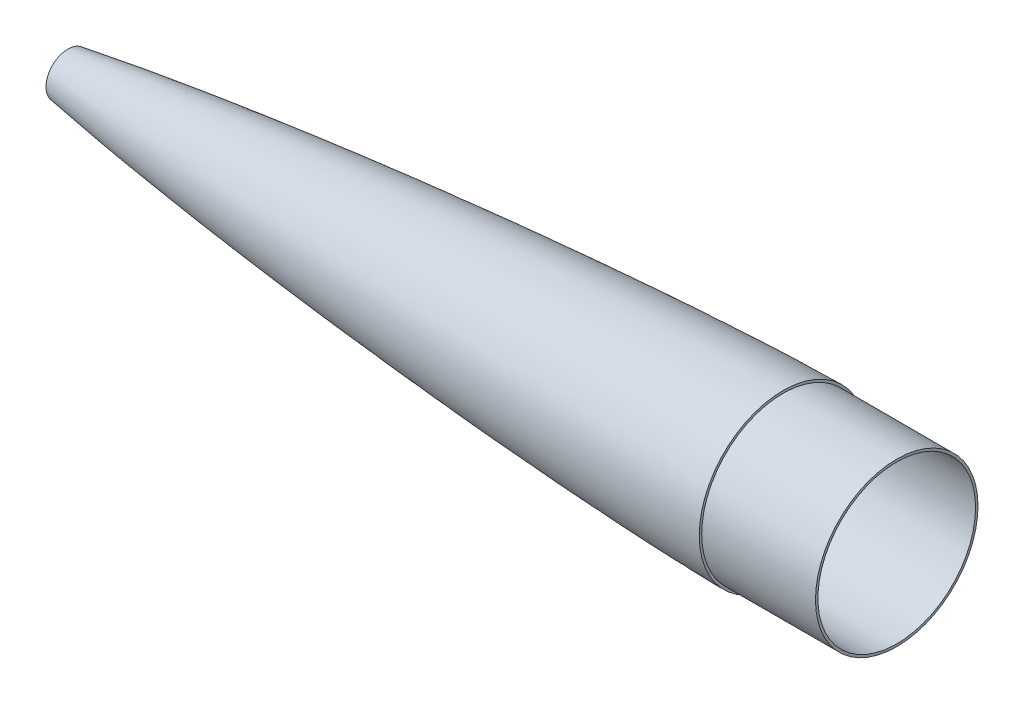
ISO-10303-21;
HEADER;
FILE_DESCRIPTION(('STEP AP214'),'2;1');
FILE_NAME('part.step','',(''),(''),'','','');
FILE_SCHEMA(('AUTOMOTIVE_DESIGN { 1 0 10303 214 1 1 1 1 }'));
ENDSEC;
DATA;
#1=APPLICATION_CONTEXT('core data for automotive mechanical design processes');
#2=APPLICATION_PROTOCOL_DEFINITION('international standard','automotive_design',2000,#1);
#3=PRODUCT_CONTEXT('',#1,'mechanical');
#4=PRODUCT('Part','Part','',(#3));
#5=PRODUCT_RELATED_PRODUCT_CATEGORY('part','',(#4));
#6=PRODUCT_DEFINITION_FORMATION('','',#4);
#7=PRODUCT_DEFINITION_CONTEXT('part definition',#1,'design');
#8=PRODUCT_DEFINITION('design','',#6,#7);
#9=PRODUCT_DEFINITION_SHAPE('','',#8);
#10=(LENGTH_UNIT() NAMED_UNIT(*) SI_UNIT(.MILLI.,.METRE.));
#11=(NAMED_UNIT(*) PLANE_ANGLE_UNIT() SI_UNIT($,.RADIAN.));
#12=(NAMED_UNIT(*) SI_UNIT($,.STERADIAN.) SOLID_ANGLE_UNIT());
#13=UNCERTAINTY_MEASURE_WITH_UNIT(LENGTH_MEASURE(1.E-05),#10,'distance_accuracy_value','');
#14=(GEOMETRIC_REPRESENTATION_CONTEXT(3) GLOBAL_UNCERTAINTY_ASSIGNED_CONTEXT((#13)) GLOBAL_UNIT_ASSIGNED_CONTEXT((#10,
#11,#12)) REPRESENTATION_CONTEXT('',''));
#15=CARTESIAN_POINT('',(0.,0.,0.));
#16=DIRECTION('',(0.,0.,1.));
#17=DIRECTION('',(1.,0.,0.));
#18=AXIS2_PLACEMENT_3D('',#15,#16,#17);
#19=CARTESIAN_POINT('',(635.,0.,-65.405));
#20=CARTESIAN_POINT('',(632.980968041379,0.,-65.3999049079982));
#21=CARTESIAN_POINT('',(628.94305151866,0.,-65.3607987649683));
#22=CARTESIAN_POINT('',(620.867800743746,0.,-65.2384258351577));
#23=CARTESIAN_POINT('',(607.876612197189,0.,-64.9420444267637));
#24=CARTESIAN_POINT('',(591.989866173893,0.,-64.4665825864282));
#25=CARTESIAN_POINT('',(568.294487812522,0.,-63.5924578117391));
#26=CARTESIAN_POINT('',(538.814064527871,0.,-62.2664605978091));
#27=CARTESIAN_POINT('',(504.434100625344,0.,-60.4361863708922));
#28=CARTESIAN_POINT('',(465.161890456535,0.,-58.0127528854531));
#29=CARTESIAN_POINT('',(425.9093857375,0.,-55.2895252497302));
#30=CARTESIAN_POINT('',(386.677550901075,0.,-52.2836135264071));
#31=CARTESIAN_POINT('',(347.467762428279,0.,-49.0025673324939));
#32=CARTESIAN_POINT('',(308.282068325666,0.,-45.4454012222469));
#33=CARTESIAN_POINT('',(269.123174714224,0.,-41.603760555562));
#34=CARTESIAN_POINT('',(229.995170684783,0.,-37.4592339547087));
#35=CARTESIAN_POINT('',(190.903568878781,0.,-32.9826992551562));
#36=CARTESIAN_POINT('',(151.85753033752,0.,-28.1241973222402));
#37=CARTESIAN_POINT('',(112.870807325212,0.,-22.8061369351956));
#38=CARTESIAN_POINT('',(77.9573287846347,0.,-17.4873019784258));
#39=CARTESIAN_POINT('',(49.1787935546812,0.,-12.5135793040534));
#40=CARTESIAN_POINT('',(28.2617417770004,0.,-8.30499279351693));
#41=CARTESIAN_POINT('',(16.0220282949452,0.,-5.4462502005679));
#42=CARTESIAN_POINT('',(8.93318062814782,0.,-3.51548578780448));
#43=CARTESIAN_POINT('',(5.16339541485648,0.,-2.32840347516784));
#44=CARTESIAN_POINT('',(3.11582679923168,0.,-1.59218900684347));
#45=CARTESIAN_POINT('',(1.97027691704136,0.,-1.1275016191836));
#46=CARTESIAN_POINT('',(1.33181141167437,0.,-0.839140676757944));
#47=CARTESIAN_POINT('',(0.956716029049632,0.,-0.653660621097922));
#48=CARTESIAN_POINT('',(0.715531562152641,0.,-0.52514659793293));
#49=CARTESIAN_POINT('',(0.550210431495344,0.,-0.431764809009295));
#50=CARTESIAN_POINT('',(0.406270251751128,0.,-0.344359984283258));
#51=CARTESIAN_POINT('',(0.283649615611131,0.,-0.263361482709999));
#52=CARTESIAN_POINT('',(0.181602895816823,0.,-0.188889432865869));
#53=CARTESIAN_POINT('',(0.109817079168361,0.,-0.130424863371354));
#54=CARTESIAN_POINT('',(0.0569836765196337,0.,-0.080426254677498));
#55=CARTESIAN_POINT('',(0.0222716682134033,0.,-0.0403845586316777));
#56=CARTESIAN_POINT('',(0.00752296936524707,0.,-0.0183675987536797));
#57=CARTESIAN_POINT('',(0.00219211488346474,0.,-0.00629020802223133));
#58=CARTESIAN_POINT('',(0.,0.,0.));
#59=B_SPLINE_CURVE_WITH_KNOTS('',4,(#19,#20,#21,#22,#23,#24,#25,#26,#27,#28,#29,#30,#31,#32,#33,
#34,#35,#36,#37,#38,#39,#40,#41,#42,#43,#44,#45,#46,#47,#48,#49,#50,#51,#52,#53,#54,#55,#56,#57,
#58),.UNSPECIFIED.,.F.,.F.,(5,1,1,1,1,1,1,1,1,1,1,1,1,1,1,1,1,1,1,1,1,1,1,1,1,1,1,1,1,1,1,1,1,1,
1,1,5),(0.,0.0126278600836156,0.0252557201672313,0.0505114403344626,0.0812725997628029,
0.112033759191143,0.173556078208551,0.235078396298971,0.296600715210933,0.358123034494871,
0.419645352372099,0.481167670690979,0.542689989321029,0.604212308113024,0.665734626856386,
0.727256945203041,0.788779262537685,0.850301578000527,0.911823895791277,0.948128969524394,
0.971421118017023,0.983729988096585,0.990421707276453,0.994070390445943,0.996134035175531,
0.997335608030765,0.998151497389768,0.998451073952135,0.998750650514502,0.999044750264593,
0.999338850014684,0.999504137511013,0.999669425007342,0.999834712503671,0.999917356251836,
0.999958678125918,1.),.UNSPECIFIED.);
#60=CARTESIAN_POINT('',(0.,0.,0.));
#61=DIRECTION('',(-1.,0.,0.));
#62=AXIS1_PLACEMENT('',#60,#61);
#63=SURFACE_OF_REVOLUTION('',#59,#62);
#64=CARTESIAN_POINT('',(76.2,0.,0.));
#65=DIRECTION('',(-1.,0.,0.));
#66=DIRECTION('',(0.,0.,1.));
#67=AXIS2_PLACEMENT_3D('',#64,#65,#66);
#68=CIRCLE('',#67,17.0521841131544);
#69=CARTESIAN_POINT('',(76.2,0.,17.0521841131544));
#70=VERTEX_POINT('',#69);
#71=EDGE_CURVE('E102',#70,#70,#68,.F.);
#72=ORIENTED_EDGE('',*,*,#71,.T.);
#73=EDGE_LOOP('',(#72));
#74=FACE_BOUND('',#73,.T.);
#75=CARTESIAN_POINT('',(635.,0.,0.));
#76=DIRECTION('',(-1.,0.,0.));
#77=DIRECTION('',(0.,0.,1.));
#78=AXIS2_PLACEMENT_3D('',#75,#76,#77);
#79=CIRCLE('',#78,65.405);
#80=CARTESIAN_POINT('',(635.,0.,65.405));
#81=VERTEX_POINT('',#80);
#82=EDGE_CURVE('E43',#81,#81,#79,.T.);
#83=ORIENTED_EDGE('',*,*,#82,.T.);
#84=EDGE_LOOP('',(#83));
#85=FACE_BOUND('',#84,.T.);
#86=ADVANCED_FACE('F35',(#74,#85),#63,.T.);
#87=CARTESIAN_POINT('',(635.,0.,0.));
#88=DIRECTION('',(-1.,0.,0.));
#89=DIRECTION('',(0.,0.,1.));
#90=AXIS2_PLACEMENT_3D('',#87,#88,#89);
#91=PLANE('',#90);
#92=CARTESIAN_POINT('',(635.,0.,0.));
#93=DIRECTION('',(-1.,0.,0.));
#94=DIRECTION('',(0.,0.,1.));
#95=AXIS2_PLACEMENT_3D('',#92,#93,#94);
#96=CIRCLE('',#95,63.5);
#97=CARTESIAN_POINT('',(635.,0.,63.5));
#98=VERTEX_POINT('',#97);
#99=EDGE_CURVE('E10',#98,#98,#96,.F.);
#100=ORIENTED_EDGE('',*,*,#99,.F.);
#101=EDGE_LOOP('',(#100));
#102=FACE_BOUND('',#101,.T.);
#103=ORIENTED_EDGE('',*,*,#82,.F.);
#104=EDGE_LOOP('',(#103));
#105=FACE_BOUND('',#104,.T.);
#106=ADVANCED_FACE('F69',(#102,#105),#91,.F.);
#107=CARTESIAN_POINT('',(723.9,0.,0.));
#108=DIRECTION('',(1.,0.,0.));
#109=DIRECTION('',(0.,0.,-1.));
#110=AXIS2_PLACEMENT_3D('',#107,#108,#109);
#111=PLANE('',#110);
#112=CARTESIAN_POINT('',(723.9,0.,0.));
#113=DIRECTION('',(1.,0.,0.));
#114=DIRECTION('',(0.,0.,-1.));
#115=AXIS2_PLACEMENT_3D('',#112,#113,#114);
#116=CIRCLE('',#115,63.5);
#117=CARTESIAN_POINT('',(723.9,0.,-63.5));
#118=VERTEX_POINT('',#117);
#119=EDGE_CURVE('E105',#118,#118,#116,.T.);
#120=ORIENTED_EDGE('',*,*,#119,.T.);
#121=EDGE_LOOP('',(#120));
#122=FACE_BOUND('',#121,.T.);
#123=CARTESIAN_POINT('',(723.9,0.,0.));
#124=DIRECTION('',(1.,0.,0.));
#125=DIRECTION('',(0.,0.,-1.));
#126=AXIS2_PLACEMENT_3D('',#123,#124,#125);
#127=CIRCLE('',#126,61.595);
#128=CARTESIAN_POINT('',(723.9,0.,-61.595));
#129=VERTEX_POINT('',#128);
#130=EDGE_CURVE('E101',#129,#129,#127,.T.);
#131=ORIENTED_EDGE('',*,*,#130,.F.);
#132=EDGE_LOOP('',(#131));
#133=FACE_BOUND('',#132,.T.);
#134=ADVANCED_FACE('F71',(#122,#133),#111,.T.);
#135=CARTESIAN_POINT('',(723.9,0.,0.));
#136=DIRECTION('',(-1.,0.,0.));
#137=DIRECTION('',(0.,0.,1.));
#138=AXIS2_PLACEMENT_3D('',#135,#136,#137);
#139=CYLINDRICAL_SURFACE('',#138,63.5);
#140=ORIENTED_EDGE('',*,*,#119,.F.);
#141=EDGE_LOOP('',(#140));
#142=FACE_BOUND('',#141,.T.);
#143=ORIENTED_EDGE('',*,*,#99,.T.);
#144=EDGE_LOOP('',(#143));
#145=FACE_BOUND('',#144,.T.);
#146=ADVANCED_FACE('F78',(#142,#145),#139,.T.);
#147=CARTESIAN_POINT('',(723.9,0.,0.));
#148=DIRECTION('',(-1.,0.,0.));
#149=DIRECTION('',(0.,0.,1.));
#150=AXIS2_PLACEMENT_3D('',#147,#148,#149);
#151=CYLINDRICAL_SURFACE('',#150,61.595);
#152=ORIENTED_EDGE('',*,*,#130,.T.);
#153=EDGE_LOOP('',(#152));
#154=FACE_BOUND('',#153,.T.);
#155=CARTESIAN_POINT('',(635.,0.,0.));
#156=DIRECTION('',(1.,0.,0.));
#157=DIRECTION('',(0.,0.,-1.));
#158=AXIS2_PLACEMENT_3D('',#155,#156,#157);
#159=CIRCLE('',#158,61.595);
#160=CARTESIAN_POINT('',(635.,0.,-61.595));
#161=VERTEX_POINT('',#160);
#162=EDGE_CURVE('E99',#161,#161,#159,.T.);
#163=ORIENTED_EDGE('',*,*,#162,.F.);
#164=EDGE_LOOP('',(#163));
#165=FACE_BOUND('',#164,.T.);
#166=ADVANCED_FACE('F92',(#154,#165),#151,.F.);
#167=CARTESIAN_POINT('',(635.,0.,-65.405));
#168=CARTESIAN_POINT('',(632.980968041379,0.,-65.3999049079982));
#169=CARTESIAN_POINT('',(628.94305151866,0.,-65.3607987649683));
#170=CARTESIAN_POINT('',(620.867800743746,0.,-65.2384258351577));
#171=CARTESIAN_POINT('',(607.876612197189,0.,-64.9420444267637));
#172=CARTESIAN_POINT('',(591.989866173893,0.,-64.4665825864282));
#173=CARTESIAN_POINT('',(568.294487812522,0.,-63.5924578117391));
#174=CARTESIAN_POINT('',(538.814064527871,0.,-62.2664605978091));
#175=CARTESIAN_POINT('',(504.434100625344,0.,-60.4361863708922));
#176=CARTESIAN_POINT('',(465.161890456535,0.,-58.0127528854531));
#177=CARTESIAN_POINT('',(425.9093857375,0.,-55.2895252497302));
#178=CARTESIAN_POINT('',(386.677550901075,0.,-52.2836135264071));
#179=CARTESIAN_POINT('',(347.467762428279,0.,-49.0025673324939));
#180=CARTESIAN_POINT('',(308.282068325666,0.,-45.4454012222469));
#181=CARTESIAN_POINT('',(269.123174714224,0.,-41.603760555562));
#182=CARTESIAN_POINT('',(229.995170684783,0.,-37.4592339547087));
#183=CARTESIAN_POINT('',(190.903568878781,0.,-32.9826992551562));
#184=CARTESIAN_POINT('',(151.85753033752,0.,-28.1241973222402));
#185=CARTESIAN_POINT('',(112.870807325212,0.,-22.8061369351956));
#186=CARTESIAN_POINT('',(77.9573287846347,0.,-17.4873019784258));
#187=CARTESIAN_POINT('',(49.1787935546812,0.,-12.5135793040534));
#188=CARTESIAN_POINT('',(28.2617417770004,0.,-8.30499279351693));
#189=CARTESIAN_POINT('',(17.0442708284475,0.,-5.68500809920104));
#190=CARTESIAN_POINT('',(11.52341991228,0.,-4.21482334150506));
#191=CARTESIAN_POINT('',(9.61139904418622,0.,-3.66908887980226));
#192=CARTESIAN_POINT('',(9.59182083879091,0.,-3.66349694212673));
#193=B_SPLINE_CURVE_WITH_KNOTS('',4,(#167,#168,#169,#170,#171,#172,#173,#174,#175,#176,#177,
#178,#179,#180,#181,#182,#183,#184,#185,#186,#187,#188,#189,#190,#191,#192),.UNSPECIFIED.,.F.,
.F.,(5,1,1,1,1,1,1,1,1,1,1,1,1,1,1,1,1,1,1,1,1,1,5),(0.,0.0126278600836156,0.0252557201672313,
0.0505114403344626,0.0812725997628029,0.112033759191143,0.173556078208551,0.235078396298971,
0.296600715210933,0.358123034494871,0.419645352372099,0.481167670690979,0.542689989321029,
0.604212308113024,0.665734626856386,0.727256945203041,0.788779262537685,0.850301578000527,
0.911823895791277,0.948128969524394,0.971421118017023,0.983729988096585,0.983857335809904),.UNSPECIFIED.);
#194=CARTESIAN_POINT('',(0.,0.,0.));
#195=DIRECTION('',(-1.,0.,0.));
#196=AXIS1_PLACEMENT('',#194,#195);
#197=SURFACE_OF_REVOLUTION('',#193,#196);
#198=OFFSET_SURFACE('',#197,-3.81,.F.);
#199=CARTESIAN_POINT('',(76.2,0.,0.));
#200=DIRECTION('',(-1.,0.,0.));
#201=DIRECTION('',(0.,0.,1.));
#202=AXIS2_PLACEMENT_3D('',#199,#200,#201);
#203=CIRCLE('',#202,13.1915237256903);
#204=CARTESIAN_POINT('',(76.2,0.,13.1915237256903));
#205=VERTEX_POINT('',#204);
#206=EDGE_CURVE('E39',#205,#205,#203,.F.);
#207=ORIENTED_EDGE('',*,*,#206,.F.);
#208=EDGE_LOOP('',(#207));
#209=FACE_BOUND('',#208,.T.);
#210=CARTESIAN_POINT('',(635.,0.,0.));
#211=DIRECTION('',(-1.,0.,0.));
#212=DIRECTION('',(0.,0.,1.));
#213=AXIS2_PLACEMENT_3D('',#210,#211,#212);
#214=CIRCLE('',#213,61.5949877444259);
#215=CARTESIAN_POINT('',(635.,0.,61.5949877444259));
#216=VERTEX_POINT('',#215);
#217=EDGE_CURVE('E47',#216,#216,#214,.T.);
#218=ORIENTED_EDGE('',*,*,#217,.F.);
#219=EDGE_LOOP('',(#218));
#220=FACE_BOUND('',#219,.T.);
#221=ADVANCED_FACE('F67',(#209,#220),#198,.F.);
#222=ORIENTED_EDGE('',*,*,#217,.T.);
#223=EDGE_LOOP('',(#222));
#224=FACE_BOUND('',#223,.T.);
#225=ORIENTED_EDGE('',*,*,#162,.T.);
#226=EDGE_LOOP('',(#225));
#227=FACE_BOUND('',#226,.T.);
#228=ADVANCED_FACE('F73',(#224,#227),#91,.F.);
#229=CARTESIAN_POINT('',(76.2,63.5000000000001,369.062));
#230=DIRECTION('',(1.,0.,0.));
#231=DIRECTION('',(0.,1.,0.));
#232=AXIS2_PLACEMENT_3D('',#229,#230,#231);
#233=PLANE('',#232);
#234=ORIENTED_EDGE('',*,*,#206,.T.);
#235=EDGE_LOOP('',(#234));
#236=FACE_BOUND('',#235,.T.);
#237=ORIENTED_EDGE('',*,*,#71,.F.);
#238=EDGE_LOOP('',(#237));
#239=FACE_BOUND('',#238,.T.);
#240=ADVANCED_FACE('F84',(#236,#239),#233,.F.);
#241=CLOSED_SHELL('',(#86,#106,#134,#146,#166,#221,#228,#240));
#242=MANIFOLD_SOLID_BREP('B2',#241);
#243=ADVANCED_BREP_SHAPE_REPRESENTATION('',(#18,#242),#14);
#244=SHAPE_DEFINITION_REPRESENTATION(#9,#243);
ENDSEC;
END-ISO-10303-21;
